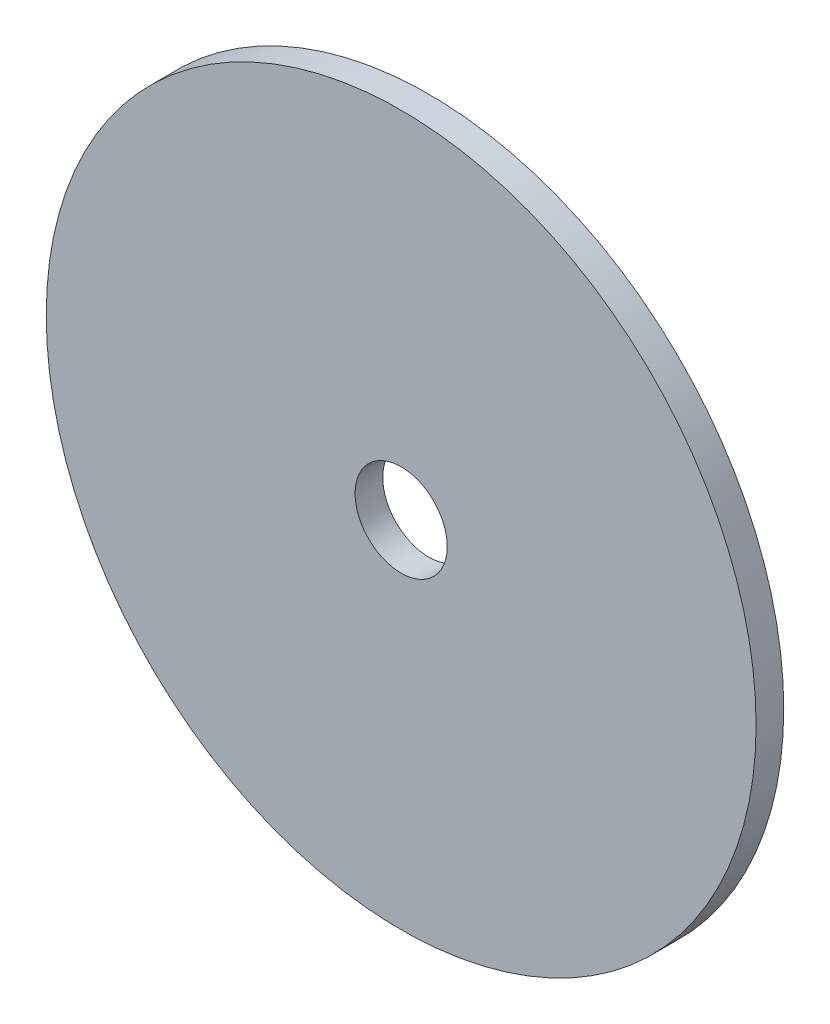
ISO-10303-21;
HEADER;
FILE_DESCRIPTION(('STEP AP214'),'2;1');
FILE_NAME('part.step','',(''),(''),'','','');
FILE_SCHEMA(('AUTOMOTIVE_DESIGN { 1 0 10303 214 1 1 1 1 }'));
ENDSEC;
DATA;
#1=APPLICATION_CONTEXT('core data for automotive mechanical design processes');
#2=APPLICATION_PROTOCOL_DEFINITION('international standard','automotive_design',2000,#1);
#3=PRODUCT_CONTEXT('',#1,'mechanical');
#4=PRODUCT('Part','Part','',(#3));
#5=PRODUCT_RELATED_PRODUCT_CATEGORY('part','',(#4));
#6=PRODUCT_DEFINITION_FORMATION('','',#4);
#7=PRODUCT_DEFINITION_CONTEXT('part definition',#1,'design');
#8=PRODUCT_DEFINITION('design','',#6,#7);
#9=PRODUCT_DEFINITION_SHAPE('','',#8);
#10=(LENGTH_UNIT() NAMED_UNIT(*) SI_UNIT(.MILLI.,.METRE.));
#11=(NAMED_UNIT(*) PLANE_ANGLE_UNIT() SI_UNIT($,.RADIAN.));
#12=(NAMED_UNIT(*) SI_UNIT($,.STERADIAN.) SOLID_ANGLE_UNIT());
#13=UNCERTAINTY_MEASURE_WITH_UNIT(LENGTH_MEASURE(1.E-05),#10,'distance_accuracy_value','');
#14=(GEOMETRIC_REPRESENTATION_CONTEXT(3) GLOBAL_UNCERTAINTY_ASSIGNED_CONTEXT((#13)) GLOBAL_UNIT_ASSIGNED_CONTEXT((#10,
#11,#12)) REPRESENTATION_CONTEXT('',''));
#15=CARTESIAN_POINT('',(0.,0.,0.));
#16=DIRECTION('',(0.,0.,1.));
#17=DIRECTION('',(1.,0.,0.));
#18=AXIS2_PLACEMENT_3D('',#15,#16,#17);
#19=CARTESIAN_POINT('',(0.,0.,6.));
#20=DIRECTION('',(0.,0.,-1.));
#21=DIRECTION('',(-1.,0.,0.));
#22=AXIS2_PLACEMENT_3D('',#19,#20,#21);
#23=CYLINDRICAL_SURFACE('',#22,77.);
#24=CARTESIAN_POINT('',(0.,0.,6.));
#25=DIRECTION('',(0.,0.,1.));
#26=DIRECTION('',(1.,0.,0.));
#27=AXIS2_PLACEMENT_3D('',#24,#25,#26);
#28=CIRCLE('',#27,77.);
#29=CARTESIAN_POINT('',(77.,0.,6.));
#30=VERTEX_POINT('',#29);
#31=EDGE_CURVE('E10',#30,#30,#28,.T.);
#32=ORIENTED_EDGE('',*,*,#31,.F.);
#33=EDGE_LOOP('',(#32));
#34=FACE_BOUND('',#33,.T.);
#35=CARTESIAN_POINT('',(0.,0.,0.));
#36=DIRECTION('',(0.,0.,1.));
#37=DIRECTION('',(1.,0.,0.));
#38=AXIS2_PLACEMENT_3D('',#35,#36,#37);
#39=CIRCLE('',#38,77.);
#40=CARTESIAN_POINT('',(77.,0.,0.));
#41=VERTEX_POINT('',#40);
#42=EDGE_CURVE('E38',#41,#41,#39,.T.);
#43=ORIENTED_EDGE('',*,*,#42,.T.);
#44=EDGE_LOOP('',(#43));
#45=FACE_BOUND('',#44,.T.);
#46=ADVANCED_FACE('F31',(#34,#45),#23,.T.);
#47=CARTESIAN_POINT('',(0.,0.,6.));
#48=DIRECTION('',(0.,0.,1.));
#49=DIRECTION('',(1.,0.,0.));
#50=AXIS2_PLACEMENT_3D('',#47,#48,#49);
#51=PLANE('',#50);
#52=CARTESIAN_POINT('',(0.,0.,6.));
#53=DIRECTION('',(0.,0.,1.));
#54=DIRECTION('',(1.,0.,0.));
#55=AXIS2_PLACEMENT_3D('',#52,#53,#54);
#56=CIRCLE('',#55,10.);
#57=CARTESIAN_POINT('',(10.,0.,6.));
#58=VERTEX_POINT('',#57);
#59=EDGE_CURVE('E44',#58,#58,#56,.T.);
#60=ORIENTED_EDGE('',*,*,#59,.F.);
#61=EDGE_LOOP('',(#60));
#62=FACE_BOUND('',#61,.T.);
#63=ORIENTED_EDGE('',*,*,#31,.T.);
#64=EDGE_LOOP('',(#63));
#65=FACE_BOUND('',#64,.T.);
#66=ADVANCED_FACE('F60',(#62,#65),#51,.T.);
#67=CARTESIAN_POINT('',(0.,0.,0.));
#68=DIRECTION('',(0.,0.,1.));
#69=DIRECTION('',(1.,0.,0.));
#70=AXIS2_PLACEMENT_3D('',#67,#68,#69);
#71=PLANE('',#70);
#72=CARTESIAN_POINT('',(0.,0.,0.));
#73=DIRECTION('',(0.,0.,1.));
#74=DIRECTION('',(1.,0.,0.));
#75=AXIS2_PLACEMENT_3D('',#72,#73,#74);
#76=CIRCLE('',#75,10.);
#77=CARTESIAN_POINT('',(10.,0.,0.));
#78=VERTEX_POINT('',#77);
#79=EDGE_CURVE('E34',#78,#78,#76,.T.);
#80=ORIENTED_EDGE('',*,*,#79,.T.);
#81=EDGE_LOOP('',(#80));
#82=FACE_BOUND('',#81,.T.);
#83=ORIENTED_EDGE('',*,*,#42,.F.);
#84=EDGE_LOOP('',(#83));
#85=FACE_BOUND('',#84,.T.);
#86=ADVANCED_FACE('F51',(#82,#85),#71,.F.);
#87=CARTESIAN_POINT('',(0.,0.,-30.));
#88=DIRECTION('',(0.,0.,1.));
#89=DIRECTION('',(1.,0.,0.));
#90=AXIS2_PLACEMENT_3D('',#87,#88,#89);
#91=CYLINDRICAL_SURFACE('',#90,10.);
#92=ORIENTED_EDGE('',*,*,#59,.T.);
#93=EDGE_LOOP('',(#92));
#94=FACE_BOUND('',#93,.T.);
#95=ORIENTED_EDGE('',*,*,#79,.F.);
#96=EDGE_LOOP('',(#95));
#97=FACE_BOUND('',#96,.T.);
#98=ADVANCED_FACE('F54',(#94,#97),#91,.F.);
#99=CLOSED_SHELL('',(#46,#66,#86,#98));
#100=MANIFOLD_SOLID_BREP('B2',#99);
#101=ADVANCED_BREP_SHAPE_REPRESENTATION('',(#18,#100),#14);
#102=SHAPE_DEFINITION_REPRESENTATION(#9,#101);
ENDSEC;
END-ISO-10303-21;
